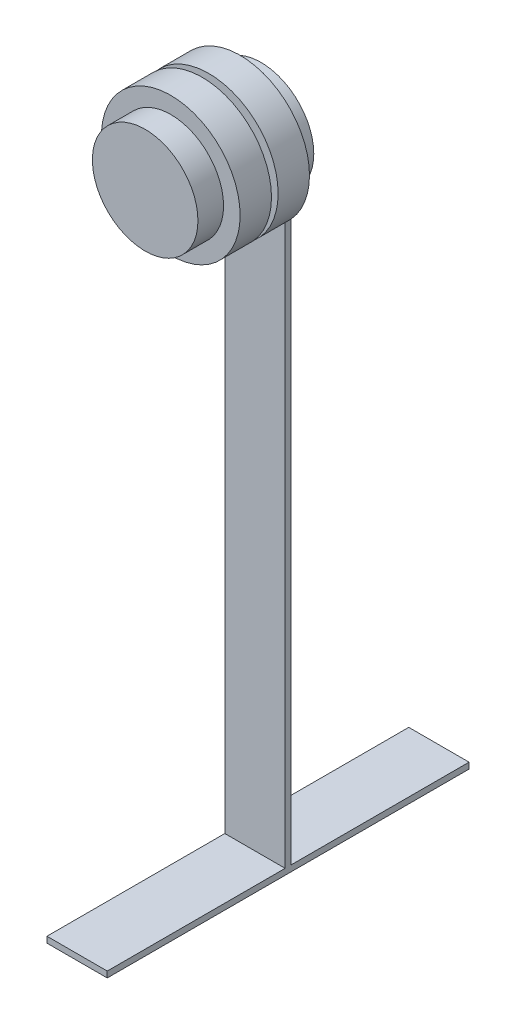
ISO-10303-21;
HEADER;
FILE_DESCRIPTION(('STEP AP214'),'2;1');
FILE_NAME('part.step','',(''),(''),'','','');
FILE_SCHEMA(('AUTOMOTIVE_DESIGN { 1 0 10303 214 1 1 1 1 }'));
ENDSEC;
DATA;
#1=APPLICATION_CONTEXT('core data for automotive mechanical design processes');
#2=APPLICATION_PROTOCOL_DEFINITION('international standard','automotive_design',2000,#1);
#3=PRODUCT_CONTEXT('',#1,'mechanical');
#4=PRODUCT('Part','Part','',(#3));
#5=PRODUCT_RELATED_PRODUCT_CATEGORY('part','',(#4));
#6=PRODUCT_DEFINITION_FORMATION('','',#4);
#7=PRODUCT_DEFINITION_CONTEXT('part definition',#1,'design');
#8=PRODUCT_DEFINITION('design','',#6,#7);
#9=PRODUCT_DEFINITION_SHAPE('','',#8);
#10=(LENGTH_UNIT() NAMED_UNIT(*) SI_UNIT(.MILLI.,.METRE.));
#11=(NAMED_UNIT(*) PLANE_ANGLE_UNIT() SI_UNIT($,.RADIAN.));
#12=(NAMED_UNIT(*) SI_UNIT($,.STERADIAN.) SOLID_ANGLE_UNIT());
#13=UNCERTAINTY_MEASURE_WITH_UNIT(LENGTH_MEASURE(1.E-05),#10,'distance_accuracy_value','');
#14=(GEOMETRIC_REPRESENTATION_CONTEXT(3) GLOBAL_UNCERTAINTY_ASSIGNED_CONTEXT((#13)) GLOBAL_UNIT_ASSIGNED_CONTEXT((#10,
#11,#12)) REPRESENTATION_CONTEXT('',''));
#15=CARTESIAN_POINT('',(0.,0.,0.));
#16=DIRECTION('',(0.,0.,1.));
#17=DIRECTION('',(1.,0.,0.));
#18=AXIS2_PLACEMENT_3D('',#15,#16,#17);
#19=CARTESIAN_POINT('',(0.,0.,-23.4));
#20=DIRECTION('',(0.,0.,1.));
#21=DIRECTION('',(1.,0.,0.));
#22=AXIS2_PLACEMENT_3D('',#19,#20,#21);
#23=PLANE('',#22);
#24=DIRECTION('',(1.,0.,0.));
#25=VECTOR('',#24,1.);
#26=CARTESIAN_POINT('',(0.,-264.16,-23.4));
#27=LINE('',#26,#25);
#28=CARTESIAN_POINT('',(-12.7,-264.16,-23.4));
#29=VERTEX_POINT('',#28);
#30=CARTESIAN_POINT('',(12.7,-264.16,-23.4));
#31=VERTEX_POINT('',#30);
#32=EDGE_CURVE('E50',#29,#31,#27,.T.);
#33=ORIENTED_EDGE('',*,*,#32,.F.);
#34=DIRECTION('',(0.,1.,0.));
#35=VECTOR('',#34,1.);
#36=CARTESIAN_POINT('',(-12.7,-266.7,-23.4));
#37=LINE('',#36,#35);
#38=CARTESIAN_POINT('',(-12.7,-18.2389864027582,-23.4));
#39=VERTEX_POINT('',#38);
#40=EDGE_CURVE('E104',#29,#39,#37,.T.);
#41=ORIENTED_EDGE('',*,*,#40,.T.);
#42=CARTESIAN_POINT('',(0.,0.,-23.4));
#43=DIRECTION('',(0.,0.,1.));
#44=DIRECTION('',(1.,0.,0.));
#45=AXIS2_PLACEMENT_3D('',#42,#43,#44);
#46=CIRCLE('',#45,22.225);
#47=CARTESIAN_POINT('',(12.7,-18.2389864027582,-23.4));
#48=VERTEX_POINT('',#47);
#49=EDGE_CURVE('E176',#48,#39,#46,.T.);
#50=ORIENTED_EDGE('',*,*,#49,.F.);
#51=DIRECTION('',(0.,-1.,0.));
#52=VECTOR('',#51,1.);
#53=CARTESIAN_POINT('',(12.7,-18.2389864027582,-23.4));
#54=LINE('',#53,#52);
#55=EDGE_CURVE('E55',#48,#31,#54,.T.);
#56=ORIENTED_EDGE('',*,*,#55,.T.);
#57=EDGE_LOOP('',(#33,#41,#50,#56));
#58=FACE_BOUND('',#57,.T.);
#59=ADVANCED_FACE('F35',(#58),#23,.F.);
#60=CARTESIAN_POINT('',(0.,0.,-20.86));
#61=DIRECTION('',(0.,0.,-1.));
#62=DIRECTION('',(-1.,0.,0.));
#63=AXIS2_PLACEMENT_3D('',#60,#61,#62);
#64=PLANE('',#63);
#65=DIRECTION('',(-1.,0.,0.));
#66=VECTOR('',#65,1.);
#67=CARTESIAN_POINT('',(0.,-264.16,-20.86));
#68=LINE('',#67,#66);
#69=CARTESIAN_POINT('',(12.7,-264.16,-20.86));
#70=VERTEX_POINT('',#69);
#71=CARTESIAN_POINT('',(-12.7,-264.16,-20.86));
#72=VERTEX_POINT('',#71);
#73=EDGE_CURVE('E11',#70,#72,#68,.T.);
#74=ORIENTED_EDGE('',*,*,#73,.F.);
#75=DIRECTION('',(0.,-1.,0.));
#76=VECTOR('',#75,1.);
#77=CARTESIAN_POINT('',(12.7,-18.2389864027582,-20.86));
#78=LINE('',#77,#76);
#79=CARTESIAN_POINT('',(12.7,-18.2389864027582,-20.86));
#80=VERTEX_POINT('',#79);
#81=EDGE_CURVE('E143',#80,#70,#78,.T.);
#82=ORIENTED_EDGE('',*,*,#81,.F.);
#83=CARTESIAN_POINT('',(0.,0.,-20.86));
#84=DIRECTION('',(0.,0.,1.));
#85=DIRECTION('',(-1.,0.,0.));
#86=AXIS2_PLACEMENT_3D('',#83,#84,#85);
#87=CIRCLE('',#86,22.225);
#88=CARTESIAN_POINT('',(-12.7,-18.2389864027582,-20.86));
#89=VERTEX_POINT('',#88);
#90=EDGE_CURVE('E141',#89,#80,#87,.T.);
#91=ORIENTED_EDGE('',*,*,#90,.F.);
#92=DIRECTION('',(0.,1.,0.));
#93=VECTOR('',#92,1.);
#94=CARTESIAN_POINT('',(-12.7,-266.7,-20.86));
#95=LINE('',#94,#93);
#96=EDGE_CURVE('E146',#72,#89,#95,.T.);
#97=ORIENTED_EDGE('',*,*,#96,.F.);
#98=EDGE_LOOP('',(#74,#82,#91,#97));
#99=FACE_BOUND('',#98,.T.);
#100=ADVANCED_FACE('F212',(#99),#64,.F.);
#101=CARTESIAN_POINT('',(0.,0.,-23.4));
#102=DIRECTION('',(0.,0.,1.));
#103=DIRECTION('',(1.,0.,0.));
#104=AXIS2_PLACEMENT_3D('',#101,#102,#103);
#105=CYLINDRICAL_SURFACE('',#104,22.225);
#106=CARTESIAN_POINT('',(0.,0.,14.605));
#107=DIRECTION('',(0.,0.,1.));
#108=DIRECTION('',(1.,0.,0.));
#109=AXIS2_PLACEMENT_3D('',#106,#107,#108);
#110=CIRCLE('',#109,22.225);
#111=CARTESIAN_POINT('',(22.225,0.,14.605));
#112=VERTEX_POINT('',#111);
#113=EDGE_CURVE('E179',#112,#112,#110,.F.);
#114=ORIENTED_EDGE('',*,*,#113,.F.);
#115=EDGE_LOOP('',(#114));
#116=FACE_BOUND('',#115,.T.);
#117=CARTESIAN_POINT('',(0.,0.,25.4));
#118=DIRECTION('',(0.,0.,1.));
#119=DIRECTION('',(1.,0.,0.));
#120=AXIS2_PLACEMENT_3D('',#117,#118,#119);
#121=CIRCLE('',#120,22.225);
#122=CARTESIAN_POINT('',(22.225,0.,25.4));
#123=VERTEX_POINT('',#122);
#124=EDGE_CURVE('E173',#123,#123,#121,.T.);
#125=ORIENTED_EDGE('',*,*,#124,.F.);
#126=EDGE_LOOP('',(#125));
#127=FACE_BOUND('',#126,.T.);
#128=ADVANCED_FACE('F37',(#116,#127),#105,.T.);
#129=CARTESIAN_POINT('',(0.,0.,25.4));
#130=DIRECTION('',(0.,0.,1.));
#131=DIRECTION('',(1.,0.,0.));
#132=AXIS2_PLACEMENT_3D('',#129,#130,#131);
#133=PLANE('',#132);
#134=ORIENTED_EDGE('',*,*,#124,.T.);
#135=EDGE_LOOP('',(#134));
#136=FACE_BOUND('',#135,.T.);
#137=ADVANCED_FACE('F219',(#136),#133,.T.);
#138=CARTESIAN_POINT('',(0.,0.,14.605));
#139=DIRECTION('',(0.,0.,-1.));
#140=DIRECTION('',(-1.,0.,0.));
#141=AXIS2_PLACEMENT_3D('',#138,#139,#140);
#142=CYLINDRICAL_SURFACE('',#141,29.21);
#143=CARTESIAN_POINT('',(0.,0.,14.605));
#144=DIRECTION('',(0.,0.,1.));
#145=DIRECTION('',(1.,0.,0.));
#146=AXIS2_PLACEMENT_3D('',#143,#144,#145);
#147=CIRCLE('',#146,29.21);
#148=CARTESIAN_POINT('',(29.21,0.,14.605));
#149=VERTEX_POINT('',#148);
#150=EDGE_CURVE('E166',#149,#149,#147,.T.);
#151=ORIENTED_EDGE('',*,*,#150,.F.);
#152=EDGE_LOOP('',(#151));
#153=FACE_BOUND('',#152,.T.);
#154=CARTESIAN_POINT('',(0.,0.,1.397));
#155=DIRECTION('',(0.,0.,1.));
#156=DIRECTION('',(1.,0.,0.));
#157=AXIS2_PLACEMENT_3D('',#154,#155,#156);
#158=CIRCLE('',#157,29.21);
#159=CARTESIAN_POINT('',(29.21,0.,1.397));
#160=VERTEX_POINT('',#159);
#161=EDGE_CURVE('E170',#160,#160,#158,.T.);
#162=ORIENTED_EDGE('',*,*,#161,.T.);
#163=EDGE_LOOP('',(#162));
#164=FACE_BOUND('',#163,.T.);
#165=ADVANCED_FACE('F222',(#153,#164),#142,.T.);
#166=CARTESIAN_POINT('',(0.,0.,14.605));
#167=DIRECTION('',(0.,0.,1.));
#168=DIRECTION('',(1.,0.,0.));
#169=AXIS2_PLACEMENT_3D('',#166,#167,#168);
#170=PLANE('',#169);
#171=ORIENTED_EDGE('',*,*,#113,.T.);
#172=EDGE_LOOP('',(#171));
#173=FACE_BOUND('',#172,.T.);
#174=ORIENTED_EDGE('',*,*,#150,.T.);
#175=EDGE_LOOP('',(#174));
#176=FACE_BOUND('',#175,.T.);
#177=ADVANCED_FACE('F226',(#173,#176),#170,.T.);
#178=CARTESIAN_POINT('',(0.,0.,1.397));
#179=DIRECTION('',(0.,0.,1.));
#180=DIRECTION('',(1.,0.,0.));
#181=AXIS2_PLACEMENT_3D('',#178,#179,#180);
#182=PLANE('',#181);
#183=CARTESIAN_POINT('',(0.,0.,1.397));
#184=DIRECTION('',(0.,0.,1.));
#185=DIRECTION('',(1.,0.,0.));
#186=AXIS2_PLACEMENT_3D('',#183,#184,#185);
#187=CIRCLE('',#186,22.225);
#188=CARTESIAN_POINT('',(22.225,0.,1.397));
#189=VERTEX_POINT('',#188);
#190=EDGE_CURVE('E169',#189,#189,#187,.F.);
#191=ORIENTED_EDGE('',*,*,#190,.F.);
#192=EDGE_LOOP('',(#191));
#193=FACE_BOUND('',#192,.T.);
#194=ORIENTED_EDGE('',*,*,#161,.F.);
#195=EDGE_LOOP('',(#194));
#196=FACE_BOUND('',#195,.T.);
#197=ADVANCED_FACE('F228',(#193,#196),#182,.F.);
#198=CARTESIAN_POINT('',(0.,0.,-1.397));
#199=DIRECTION('',(0.,0.,1.));
#200=DIRECTION('',(1.,0.,0.));
#201=AXIS2_PLACEMENT_3D('',#198,#199,#200);
#202=CIRCLE('',#201,22.225);
#203=CARTESIAN_POINT('',(22.225,0.,-1.397));
#204=VERTEX_POINT('',#203);
#205=EDGE_CURVE('E43',#204,#204,#202,.F.);
#206=ORIENTED_EDGE('',*,*,#205,.F.);
#207=EDGE_LOOP('',(#206));
#208=FACE_BOUND('',#207,.T.);
#209=ORIENTED_EDGE('',*,*,#190,.T.);
#210=EDGE_LOOP('',(#209));
#211=FACE_BOUND('',#210,.T.);
#212=ADVANCED_FACE('F200',(#208,#211),#105,.T.);
#213=CARTESIAN_POINT('',(0.,0.,-14.605));
#214=DIRECTION('',(0.,0.,1.));
#215=DIRECTION('',(1.,0.,0.));
#216=AXIS2_PLACEMENT_3D('',#213,#214,#215);
#217=CYLINDRICAL_SURFACE('',#216,29.21);
#218=CARTESIAN_POINT('',(0.,0.,-14.605));
#219=DIRECTION('',(0.,0.,1.));
#220=DIRECTION('',(1.,0.,0.));
#221=AXIS2_PLACEMENT_3D('',#218,#219,#220);
#222=CIRCLE('',#221,29.21);
#223=CARTESIAN_POINT('',(29.21,0.,-14.605));
#224=VERTEX_POINT('',#223);
#225=EDGE_CURVE('E160',#224,#224,#222,.T.);
#226=ORIENTED_EDGE('',*,*,#225,.T.);
#227=EDGE_LOOP('',(#226));
#228=FACE_BOUND('',#227,.T.);
#229=CARTESIAN_POINT('',(0.,0.,-1.397));
#230=DIRECTION('',(0.,0.,1.));
#231=DIRECTION('',(1.,0.,0.));
#232=AXIS2_PLACEMENT_3D('',#229,#230,#231);
#233=CIRCLE('',#232,29.21);
#234=CARTESIAN_POINT('',(29.21,0.,-1.397));
#235=VERTEX_POINT('',#234);
#236=EDGE_CURVE('E153',#235,#235,#233,.T.);
#237=ORIENTED_EDGE('',*,*,#236,.F.);
#238=EDGE_LOOP('',(#237));
#239=FACE_BOUND('',#238,.T.);
#240=ADVANCED_FACE('F194',(#228,#239),#217,.T.);
#241=CARTESIAN_POINT('',(0.,0.,-14.605));
#242=DIRECTION('',(0.,0.,1.));
#243=DIRECTION('',(1.,0.,0.));
#244=AXIS2_PLACEMENT_3D('',#241,#242,#243);
#245=PLANE('',#244);
#246=CARTESIAN_POINT('',(0.,0.,-14.605));
#247=DIRECTION('',(0.,0.,1.));
#248=DIRECTION('',(1.,0.,0.));
#249=AXIS2_PLACEMENT_3D('',#246,#247,#248);
#250=CIRCLE('',#249,22.225);
#251=CARTESIAN_POINT('',(22.225,0.,-14.605));
#252=VERTEX_POINT('',#251);
#253=EDGE_CURVE('E163',#252,#252,#250,.F.);
#254=ORIENTED_EDGE('',*,*,#253,.F.);
#255=EDGE_LOOP('',(#254));
#256=FACE_BOUND('',#255,.T.);
#257=ORIENTED_EDGE('',*,*,#225,.F.);
#258=EDGE_LOOP('',(#257));
#259=FACE_BOUND('',#258,.T.);
#260=ADVANCED_FACE('F190',(#256,#259),#245,.F.);
#261=CARTESIAN_POINT('',(0.,0.,-1.397));
#262=DIRECTION('',(0.,0.,1.));
#263=DIRECTION('',(1.,0.,0.));
#264=AXIS2_PLACEMENT_3D('',#261,#262,#263);
#265=PLANE('',#264);
#266=ORIENTED_EDGE('',*,*,#205,.T.);
#267=EDGE_LOOP('',(#266));
#268=FACE_BOUND('',#267,.T.);
#269=ORIENTED_EDGE('',*,*,#236,.T.);
#270=EDGE_LOOP('',(#269));
#271=FACE_BOUND('',#270,.T.);
#272=ADVANCED_FACE('F193',(#268,#271),#265,.T.);
#273=DIRECTION('',(0.,0.,-1.));
#274=VECTOR('',#273,1.);
#275=CARTESIAN_POINT('',(-12.7,-18.2389864027582,-20.86));
#276=LINE('',#275,#274);
#277=EDGE_CURVE('E151',#89,#39,#276,.T.);
#278=ORIENTED_EDGE('',*,*,#277,.F.);
#279=ORIENTED_EDGE('',*,*,#90,.T.);
#280=DIRECTION('',(0.,0.,-1.));
#281=VECTOR('',#280,1.);
#282=CARTESIAN_POINT('',(12.7,-18.2389864027582,-20.86));
#283=LINE('',#282,#281);
#284=EDGE_CURVE('E148',#80,#48,#283,.T.);
#285=ORIENTED_EDGE('',*,*,#284,.T.);
#286=ORIENTED_EDGE('',*,*,#49,.T.);
#287=EDGE_LOOP('',(#278,#279,#285,#286));
#288=FACE_BOUND('',#287,.T.);
#289=ORIENTED_EDGE('',*,*,#253,.T.);
#290=EDGE_LOOP('',(#289));
#291=FACE_BOUND('',#290,.T.);
#292=ADVANCED_FACE('F188',(#288,#291),#105,.T.);
#293=CARTESIAN_POINT('',(-12.7,-266.7,-20.86));
#294=DIRECTION('',(-1.,0.,0.));
#295=DIRECTION('',(0.,-1.,0.));
#296=AXIS2_PLACEMENT_3D('',#293,#294,#295);
#297=PLANE('',#296);
#298=DIRECTION('',(0.,0.,-1.));
#299=VECTOR('',#298,1.);
#300=CARTESIAN_POINT('',(-12.7,-264.16,-98.33));
#301=LINE('',#300,#299);
#302=CARTESIAN_POINT('',(-12.7,-264.16,54.07));
#303=VERTEX_POINT('',#302);
#304=EDGE_CURVE('E107',#303,#72,#301,.T.);
#305=ORIENTED_EDGE('',*,*,#304,.T.);
#306=ORIENTED_EDGE('',*,*,#96,.T.);
#307=ORIENTED_EDGE('',*,*,#277,.T.);
#308=ORIENTED_EDGE('',*,*,#40,.F.);
#309=CARTESIAN_POINT('',(-12.7,-264.16,-98.33));
#310=VERTEX_POINT('',#309);
#311=EDGE_CURVE('E97',#29,#310,#301,.T.);
#312=ORIENTED_EDGE('',*,*,#311,.T.);
#313=DIRECTION('',(0.,-1.,0.));
#314=VECTOR('',#313,1.);
#315=CARTESIAN_POINT('',(-12.7,-264.16,-98.33));
#316=LINE('',#315,#314);
#317=CARTESIAN_POINT('',(-12.7,-266.7,-98.33));
#318=VERTEX_POINT('',#317);
#319=EDGE_CURVE('E101',#310,#318,#316,.T.);
#320=ORIENTED_EDGE('',*,*,#319,.T.);
#321=DIRECTION('',(0.,0.,-1.));
#322=VECTOR('',#321,1.);
#323=CARTESIAN_POINT('',(-12.7,-266.7,-20.86));
#324=LINE('',#323,#322);
#325=CARTESIAN_POINT('',(-12.7,-266.7,54.07));
#326=VERTEX_POINT('',#325);
#327=EDGE_CURVE('E154',#326,#318,#324,.T.);
#328=ORIENTED_EDGE('',*,*,#327,.F.);
#329=DIRECTION('',(0.,-1.,0.));
#330=VECTOR('',#329,1.);
#331=CARTESIAN_POINT('',(-12.7,-264.16,54.07));
#332=LINE('',#331,#330);
#333=EDGE_CURVE('E133',#303,#326,#332,.T.);
#334=ORIENTED_EDGE('',*,*,#333,.F.);
#335=EDGE_LOOP('',(#305,#306,#307,#308,#312,#320,#328,#334));
#336=FACE_BOUND('',#335,.T.);
#337=ADVANCED_FACE('F100',(#336),#297,.T.);
#338=CARTESIAN_POINT('',(12.7,-266.7,-20.86));
#339=DIRECTION('',(0.,-1.,0.));
#340=DIRECTION('',(0.,0.,-1.));
#341=AXIS2_PLACEMENT_3D('',#338,#339,#340);
#342=PLANE('',#341);
#343=ORIENTED_EDGE('',*,*,#327,.T.);
#344=DIRECTION('',(1.,0.,0.));
#345=VECTOR('',#344,1.);
#346=CARTESIAN_POINT('',(12.7,-266.7,-98.33));
#347=LINE('',#346,#345);
#348=CARTESIAN_POINT('',(12.7,-266.7,-98.33));
#349=VERTEX_POINT('',#348);
#350=EDGE_CURVE('E116',#318,#349,#347,.T.);
#351=ORIENTED_EDGE('',*,*,#350,.T.);
#352=DIRECTION('',(0.,0.,-1.));
#353=VECTOR('',#352,1.);
#354=CARTESIAN_POINT('',(12.7,-266.7,-20.86));
#355=LINE('',#354,#353);
#356=CARTESIAN_POINT('',(12.7,-266.7,54.07));
#357=VERTEX_POINT('',#356);
#358=EDGE_CURVE('E156',#357,#349,#355,.T.);
#359=ORIENTED_EDGE('',*,*,#358,.F.);
#360=DIRECTION('',(-1.,0.,0.));
#361=VECTOR('',#360,1.);
#362=CARTESIAN_POINT('',(12.7,-266.7,54.07));
#363=LINE('',#362,#361);
#364=EDGE_CURVE('E108',#357,#326,#363,.T.);
#365=ORIENTED_EDGE('',*,*,#364,.T.);
#366=EDGE_LOOP('',(#343,#351,#359,#365));
#367=FACE_BOUND('',#366,.T.);
#368=ADVANCED_FACE('F298',(#367),#342,.T.);
#369=CARTESIAN_POINT('',(12.7,-18.2389864027582,-20.86));
#370=DIRECTION('',(1.,0.,0.));
#371=DIRECTION('',(0.,1.,0.));
#372=AXIS2_PLACEMENT_3D('',#369,#370,#371);
#373=PLANE('',#372);
#374=ORIENTED_EDGE('',*,*,#358,.T.);
#375=DIRECTION('',(0.,-1.,0.));
#376=VECTOR('',#375,1.);
#377=CARTESIAN_POINT('',(12.7,-264.16,-98.33));
#378=LINE('',#377,#376);
#379=CARTESIAN_POINT('',(12.7,-264.16,-98.33));
#380=VERTEX_POINT('',#379);
#381=EDGE_CURVE('E117',#380,#349,#378,.T.);
#382=ORIENTED_EDGE('',*,*,#381,.F.);
#383=DIRECTION('',(0.,0.,1.));
#384=VECTOR('',#383,1.);
#385=CARTESIAN_POINT('',(12.7,-264.16,-98.33));
#386=LINE('',#385,#384);
#387=EDGE_CURVE('E123',#380,#31,#386,.T.);
#388=ORIENTED_EDGE('',*,*,#387,.T.);
#389=ORIENTED_EDGE('',*,*,#55,.F.);
#390=ORIENTED_EDGE('',*,*,#284,.F.);
#391=ORIENTED_EDGE('',*,*,#81,.T.);
#392=CARTESIAN_POINT('',(12.7,-264.16,54.07));
#393=VERTEX_POINT('',#392);
#394=EDGE_CURVE('E124',#70,#393,#386,.T.);
#395=ORIENTED_EDGE('',*,*,#394,.T.);
#396=DIRECTION('',(0.,-1.,0.));
#397=VECTOR('',#396,1.);
#398=CARTESIAN_POINT('',(12.7,-264.16,54.07));
#399=LINE('',#398,#397);
#400=EDGE_CURVE('E136',#393,#357,#399,.T.);
#401=ORIENTED_EDGE('',*,*,#400,.T.);
#402=EDGE_LOOP('',(#374,#382,#388,#389,#390,#391,#395,#401));
#403=FACE_BOUND('',#402,.T.);
#404=ADVANCED_FACE('F307',(#403),#373,.T.);
#405=CARTESIAN_POINT('',(12.7,-264.16,54.07));
#406=DIRECTION('',(0.,0.,1.));
#407=DIRECTION('',(1.,0.,0.));
#408=AXIS2_PLACEMENT_3D('',#405,#406,#407);
#409=PLANE('',#408);
#410=ORIENTED_EDGE('',*,*,#364,.F.);
#411=ORIENTED_EDGE('',*,*,#400,.F.);
#412=DIRECTION('',(-1.,0.,0.));
#413=VECTOR('',#412,1.);
#414=CARTESIAN_POINT('',(12.7,-264.16,54.07));
#415=LINE('',#414,#413);
#416=EDGE_CURVE('E118',#393,#303,#415,.T.);
#417=ORIENTED_EDGE('',*,*,#416,.T.);
#418=ORIENTED_EDGE('',*,*,#333,.T.);
#419=EDGE_LOOP('',(#410,#411,#417,#418));
#420=FACE_BOUND('',#419,.T.);
#421=ADVANCED_FACE('F318',(#420),#409,.T.);
#422=CARTESIAN_POINT('',(0.,-264.16,0.));
#423=DIRECTION('',(0.,-1.,0.));
#424=DIRECTION('',(0.,0.,-1.));
#425=AXIS2_PLACEMENT_3D('',#422,#423,#424);
#426=PLANE('',#425);
#427=ORIENTED_EDGE('',*,*,#394,.F.);
#428=ORIENTED_EDGE('',*,*,#73,.T.);
#429=ORIENTED_EDGE('',*,*,#304,.F.);
#430=ORIENTED_EDGE('',*,*,#416,.F.);
#431=EDGE_LOOP('',(#427,#428,#429,#430));
#432=FACE_BOUND('',#431,.T.);
#433=ADVANCED_FACE('F328',(#432),#426,.F.);
#434=ORIENTED_EDGE('',*,*,#311,.F.);
#435=ORIENTED_EDGE('',*,*,#32,.T.);
#436=ORIENTED_EDGE('',*,*,#387,.F.);
#437=DIRECTION('',(1.,0.,0.));
#438=VECTOR('',#437,1.);
#439=CARTESIAN_POINT('',(12.7,-264.16,-98.33));
#440=LINE('',#439,#438);
#441=EDGE_CURVE('E114',#310,#380,#440,.T.);
#442=ORIENTED_EDGE('',*,*,#441,.F.);
#443=EDGE_LOOP('',(#434,#435,#436,#442));
#444=FACE_BOUND('',#443,.T.);
#445=ADVANCED_FACE('F121',(#444),#426,.F.);
#446=CARTESIAN_POINT('',(12.7,-264.16,-98.33));
#447=DIRECTION('',(0.,0.,-1.));
#448=DIRECTION('',(-1.,0.,0.));
#449=AXIS2_PLACEMENT_3D('',#446,#447,#448);
#450=PLANE('',#449);
#451=ORIENTED_EDGE('',*,*,#350,.F.);
#452=ORIENTED_EDGE('',*,*,#319,.F.);
#453=ORIENTED_EDGE('',*,*,#441,.T.);
#454=ORIENTED_EDGE('',*,*,#381,.T.);
#455=EDGE_LOOP('',(#451,#452,#453,#454));
#456=FACE_BOUND('',#455,.T.);
#457=ADVANCED_FACE('F112',(#456),#450,.T.);
#458=CLOSED_SHELL('',(#59,#100,#128,#137,#165,#177,#197,#212,#240,#260,#272,#292,#337,#368,#404,
#421,#433,#445,#457));
#459=MANIFOLD_SOLID_BREP('B2',#458);
#460=ADVANCED_BREP_SHAPE_REPRESENTATION('',(#18,#459),#14);
#461=SHAPE_DEFINITION_REPRESENTATION(#9,#460);
ENDSEC;
END-ISO-10303-21;
